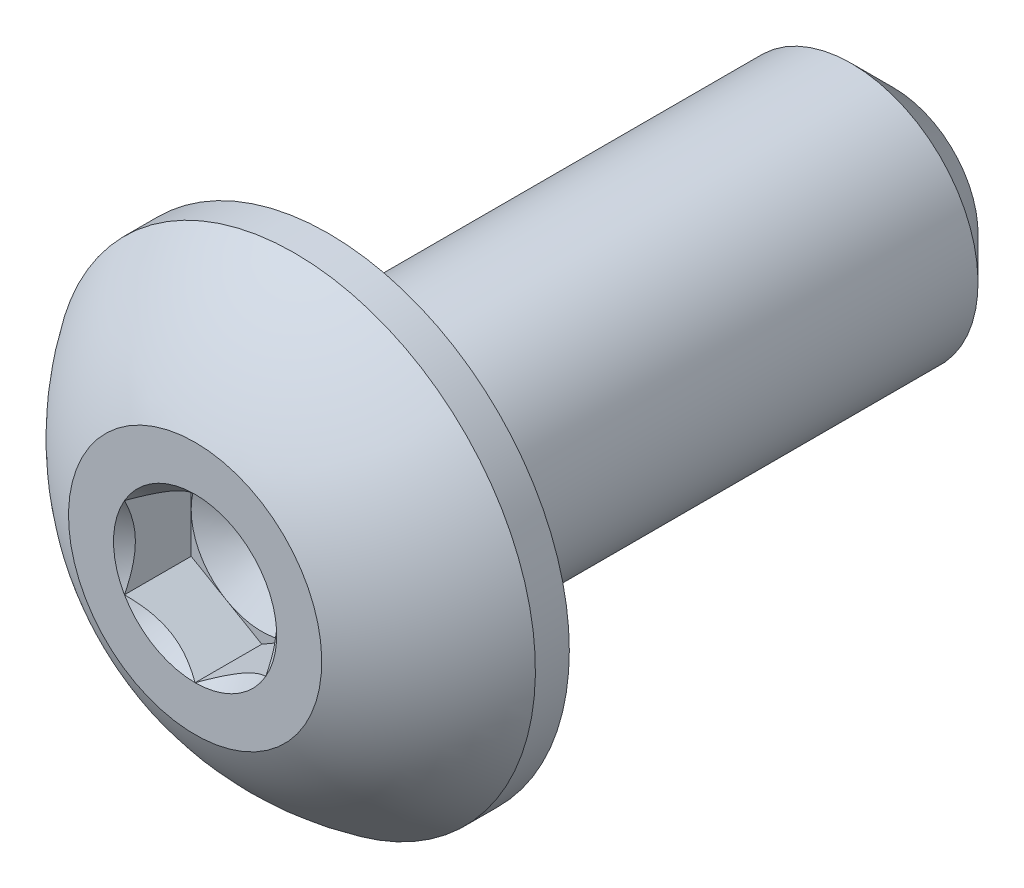
ISO-10303-21;
HEADER;
FILE_DESCRIPTION(('STEP AP214'),'2;1');
FILE_NAME('part.step','',(''),(''),'','','');
FILE_SCHEMA(('AUTOMOTIVE_DESIGN { 1 0 10303 214 1 1 1 1 }'));
ENDSEC;
DATA;
#1=APPLICATION_CONTEXT('core data for automotive mechanical design processes');
#2=APPLICATION_PROTOCOL_DEFINITION('international standard','automotive_design',2000,#1);
#3=PRODUCT_CONTEXT('',#1,'mechanical');
#4=PRODUCT('Part','Part','',(#3));
#5=PRODUCT_RELATED_PRODUCT_CATEGORY('part','',(#4));
#6=PRODUCT_DEFINITION_FORMATION('','',#4);
#7=PRODUCT_DEFINITION_CONTEXT('part definition',#1,'design');
#8=PRODUCT_DEFINITION('design','',#6,#7);
#9=PRODUCT_DEFINITION_SHAPE('','',#8);
#10=(LENGTH_UNIT() NAMED_UNIT(*) SI_UNIT(.MILLI.,.METRE.));
#11=(NAMED_UNIT(*) PLANE_ANGLE_UNIT() SI_UNIT($,.RADIAN.));
#12=(NAMED_UNIT(*) SI_UNIT($,.STERADIAN.) SOLID_ANGLE_UNIT());
#13=UNCERTAINTY_MEASURE_WITH_UNIT(LENGTH_MEASURE(1.E-05),#10,'distance_accuracy_value','');
#14=(GEOMETRIC_REPRESENTATION_CONTEXT(3) GLOBAL_UNCERTAINTY_ASSIGNED_CONTEXT((#13)) GLOBAL_UNIT_ASSIGNED_CONTEXT((#10,
#11,#12)) REPRESENTATION_CONTEXT('',''));
#15=CARTESIAN_POINT('',(0.,0.,0.));
#16=DIRECTION('',(0.,0.,1.));
#17=DIRECTION('',(1.,0.,0.));
#18=AXIS2_PLACEMENT_3D('',#15,#16,#17);
#19=CARTESIAN_POINT('',(0.79375,-1.3748153285078,0.7493));
#20=DIRECTION('',(0.,0.,1.));
#21=DIRECTION('',(1.,0.,0.));
#22=AXIS2_PLACEMENT_3D('',#19,#20,#21);
#23=PLANE('',#22);
#24=CARTESIAN_POINT('',(0.,0.,0.7493));
#25=DIRECTION('',(0.,0.,1.));
#26=DIRECTION('',(1.,0.,0.));
#27=AXIS2_PLACEMENT_3D('',#24,#25,#26);
#28=CIRCLE('',#27,0.79375);
#29=CARTESIAN_POINT('',(0.79375,0.,0.7493));
#30=VERTEX_POINT('',#29);
#31=CARTESIAN_POINT('',(0.396875,0.687407664253898,0.7493));
#32=VERTEX_POINT('',#31);
#33=EDGE_CURVE('E42',#30,#32,#28,.T.);
#34=ORIENTED_EDGE('',*,*,#33,.F.);
#35=DIRECTION('',(0.,1.,0.));
#36=VECTOR('',#35,1.);
#37=CARTESIAN_POINT('',(0.79375,-0.458271776169264,0.7493));
#38=LINE('',#37,#36);
#39=CARTESIAN_POINT('',(0.79375,0.458271776169267,0.7493));
#40=VERTEX_POINT('',#39);
#41=EDGE_CURVE('E112',#30,#40,#38,.T.);
#42=ORIENTED_EDGE('',*,*,#41,.T.);
#43=DIRECTION('',(-0.866025403784438,0.5,0.));
#44=VECTOR('',#43,1.);
#45=CARTESIAN_POINT('',(0.79375,0.458271776169267,0.7493));
#46=LINE('',#45,#44);
#47=EDGE_CURVE('E115',#40,#32,#46,.T.);
#48=ORIENTED_EDGE('',*,*,#47,.T.);
#49=EDGE_LOOP('',(#34,#42,#48));
#50=FACE_BOUND('',#49,.T.);
#51=ADVANCED_FACE('F31',(#50),#23,.T.);
#52=CARTESIAN_POINT('',(-0.396875,0.687407664253899,0.7493));
#53=VERTEX_POINT('',#52);
#54=EDGE_CURVE('E11',#32,#53,#28,.T.);
#55=ORIENTED_EDGE('',*,*,#54,.F.);
#56=CARTESIAN_POINT('',(0.,0.916543552338533,0.7493));
#57=VERTEX_POINT('',#56);
#58=EDGE_CURVE('E129',#32,#57,#46,.T.);
#59=ORIENTED_EDGE('',*,*,#58,.T.);
#60=DIRECTION('',(-0.866025403784439,-0.5,0.));
#61=VECTOR('',#60,1.);
#62=CARTESIAN_POINT('',(0.,0.916543552338533,0.7493));
#63=LINE('',#62,#61);
#64=EDGE_CURVE('E135',#57,#53,#63,.T.);
#65=ORIENTED_EDGE('',*,*,#64,.T.);
#66=EDGE_LOOP('',(#55,#59,#65));
#67=FACE_BOUND('',#66,.T.);
#68=ADVANCED_FACE('F191',(#67),#23,.T.);
#69=CARTESIAN_POINT('',(-0.79375,0.,0.7493));
#70=VERTEX_POINT('',#69);
#71=EDGE_CURVE('E40',#53,#70,#28,.T.);
#72=ORIENTED_EDGE('',*,*,#71,.F.);
#73=CARTESIAN_POINT('',(-0.79375,0.458271776169267,0.7493));
#74=VERTEX_POINT('',#73);
#75=EDGE_CURVE('E134',#53,#74,#63,.T.);
#76=ORIENTED_EDGE('',*,*,#75,.T.);
#77=DIRECTION('',(0.,-1.,0.));
#78=VECTOR('',#77,1.);
#79=CARTESIAN_POINT('',(-0.79375,0.458271776169267,0.7493));
#80=LINE('',#79,#78);
#81=EDGE_CURVE('E139',#74,#70,#80,.T.);
#82=ORIENTED_EDGE('',*,*,#81,.T.);
#83=EDGE_LOOP('',(#72,#76,#82));
#84=FACE_BOUND('',#83,.T.);
#85=ADVANCED_FACE('F196',(#84),#23,.T.);
#86=CARTESIAN_POINT('',(-0.396875,-0.687407664253898,0.7493));
#87=VERTEX_POINT('',#86);
#88=EDGE_CURVE('E226',#70,#87,#28,.T.);
#89=ORIENTED_EDGE('',*,*,#88,.F.);
#90=CARTESIAN_POINT('',(-0.79375,-0.458271776169264,0.7493));
#91=VERTEX_POINT('',#90);
#92=EDGE_CURVE('E138',#70,#91,#80,.T.);
#93=ORIENTED_EDGE('',*,*,#92,.T.);
#94=DIRECTION('',(0.866025403784439,-0.5,0.));
#95=VECTOR('',#94,1.);
#96=CARTESIAN_POINT('',(-0.79375,-0.458271776169264,0.7493));
#97=LINE('',#96,#95);
#98=EDGE_CURVE('E231',#91,#87,#97,.T.);
#99=ORIENTED_EDGE('',*,*,#98,.T.);
#100=EDGE_LOOP('',(#89,#93,#99));
#101=FACE_BOUND('',#100,.T.);
#102=ADVANCED_FACE('F214',(#101),#23,.T.);
#103=CARTESIAN_POINT('',(0.396874999999999,-0.687407664253897,0.7493));
#104=VERTEX_POINT('',#103);
#105=EDGE_CURVE('E49',#87,#104,#28,.T.);
#106=ORIENTED_EDGE('',*,*,#105,.F.);
#107=CARTESIAN_POINT('',(0.,-0.916543552338529,0.7493));
#108=VERTEX_POINT('',#107);
#109=EDGE_CURVE('E223',#87,#108,#97,.T.);
#110=ORIENTED_EDGE('',*,*,#109,.T.);
#111=DIRECTION('',(0.866025403784439,0.5,0.));
#112=VECTOR('',#111,1.);
#113=CARTESIAN_POINT('',(0.,-0.916543552338529,0.7493));
#114=LINE('',#113,#112);
#115=EDGE_CURVE('E124',#108,#104,#114,.T.);
#116=ORIENTED_EDGE('',*,*,#115,.T.);
#117=EDGE_LOOP('',(#106,#110,#116));
#118=FACE_BOUND('',#117,.T.);
#119=ADVANCED_FACE('F203',(#118),#23,.T.);
#120=CARTESIAN_POINT('',(0.,0.,0.));
#121=DIRECTION('',(0.,0.,-1.));
#122=DIRECTION('',(0.,1.,0.));
#123=AXIS2_PLACEMENT_3D('',#120,#121,#122);
#124=CYLINDRICAL_SURFACE('',#123,1.4224);
#125=CARTESIAN_POINT('',(0.,0.,-5.87374999999999));
#126=DIRECTION('',(0.,0.,-1.));
#127=DIRECTION('',(0.,1.,0.));
#128=AXIS2_PLACEMENT_3D('',#125,#126,#127);
#129=CIRCLE('',#128,1.4224);
#130=CARTESIAN_POINT('',(0.,1.4224,-5.87374999999999));
#131=VERTEX_POINT('',#130);
#132=EDGE_CURVE('E35',#131,#131,#129,.F.);
#133=ORIENTED_EDGE('',*,*,#132,.T.);
#134=EDGE_LOOP('',(#133));
#135=FACE_BOUND('',#134,.T.);
#136=CARTESIAN_POINT('',(0.,0.,0.));
#137=DIRECTION('',(0.,0.,1.));
#138=DIRECTION('',(1.,0.,0.));
#139=AXIS2_PLACEMENT_3D('',#136,#137,#138);
#140=CIRCLE('',#139,1.4224);
#141=CARTESIAN_POINT('',(1.4224,0.,0.));
#142=VERTEX_POINT('',#141);
#143=EDGE_CURVE('E166',#142,#142,#140,.F.);
#144=ORIENTED_EDGE('',*,*,#143,.T.);
#145=EDGE_LOOP('',(#144));
#146=FACE_BOUND('',#145,.T.);
#147=ADVANCED_FACE('F175',(#135,#146),#124,.T.);
#148=CARTESIAN_POINT('',(0.,0.,-6.35));
#149=DIRECTION('',(0.,0.,-1.));
#150=DIRECTION('',(0.,1.,0.));
#151=AXIS2_PLACEMENT_3D('',#148,#149,#150);
#152=PLANE('',#151);
#153=CARTESIAN_POINT('',(0.,0.,-6.35));
#154=DIRECTION('',(0.,0.,-1.));
#155=DIRECTION('',(0.,1.,0.));
#156=AXIS2_PLACEMENT_3D('',#153,#154,#155);
#157=CIRCLE('',#156,0.946149999999999);
#158=CARTESIAN_POINT('',(0.,0.94615,-6.35));
#159=VERTEX_POINT('',#158);
#160=EDGE_CURVE('E168',#159,#159,#157,.T.);
#161=ORIENTED_EDGE('',*,*,#160,.T.);
#162=EDGE_LOOP('',(#161));
#163=FACE_BOUND('',#162,.T.);
#164=ADVANCED_FACE('F181',(#163),#152,.T.);
#165=CARTESIAN_POINT('',(0.,0.,-6.35));
#166=DIRECTION('',(0.,0.,1.));
#167=DIRECTION('',(0.,-1.,0.));
#168=AXIS2_PLACEMENT_3D('',#165,#166,#167);
#169=CONICAL_SURFACE('',#168,0.946149999999999,0.785398163397445);
#170=ORIENTED_EDGE('',*,*,#132,.F.);
#171=EDGE_LOOP('',(#170));
#172=FACE_BOUND('',#171,.T.);
#173=ORIENTED_EDGE('',*,*,#160,.F.);
#174=EDGE_LOOP('',(#173));
#175=FACE_BOUND('',#174,.T.);
#176=ADVANCED_FACE('F33',(#172,#175),#169,.T.);
#177=CARTESIAN_POINT('',(0.,0.,9.14977821515092));
#178=DIRECTION('',(0.,0.,-1.));
#179=DIRECTION('',(-1.,0.,0.));
#180=AXIS2_PLACEMENT_3D('',#177,#178,#179);
#181=CYLINDRICAL_SURFACE('',#180,2.7051);
#182=CARTESIAN_POINT('',(0.,0.,0.381));
#183=DIRECTION('',(0.,0.,-1.));
#184=DIRECTION('',(0.,1.,0.));
#185=AXIS2_PLACEMENT_3D('',#182,#183,#184);
#186=CIRCLE('',#185,2.7051);
#187=CARTESIAN_POINT('',(0.,2.7051,0.381));
#188=VERTEX_POINT('',#187);
#189=EDGE_CURVE('E160',#188,#188,#186,.T.);
#190=ORIENTED_EDGE('',*,*,#189,.T.);
#191=EDGE_LOOP('',(#190));
#192=FACE_BOUND('',#191,.T.);
#193=CARTESIAN_POINT('',(0.,0.,0.));
#194=DIRECTION('',(0.,0.,1.));
#195=DIRECTION('',(1.,0.,0.));
#196=AXIS2_PLACEMENT_3D('',#193,#194,#195);
#197=CIRCLE('',#196,2.7051);
#198=CARTESIAN_POINT('',(2.7051,0.,0.));
#199=VERTEX_POINT('',#198);
#200=EDGE_CURVE('E163',#199,#199,#197,.T.);
#201=ORIENTED_EDGE('',*,*,#200,.T.);
#202=EDGE_LOOP('',(#201));
#203=FACE_BOUND('',#202,.T.);
#204=ADVANCED_FACE('F180',(#192,#203),#181,.T.);
#205=CARTESIAN_POINT('',(0.,0.,0.));
#206=DIRECTION('',(0.,0.,1.));
#207=DIRECTION('',(1.,0.,0.));
#208=AXIS2_PLACEMENT_3D('',#205,#206,#207);
#209=PLANE('',#208);
#210=ORIENTED_EDGE('',*,*,#143,.F.);
#211=EDGE_LOOP('',(#210));
#212=FACE_BOUND('',#211,.T.);
#213=ORIENTED_EDGE('',*,*,#200,.F.);
#214=EDGE_LOOP('',(#213));
#215=FACE_BOUND('',#214,.T.);
#216=ADVANCED_FACE('F186',(#212,#215),#209,.F.);
#217=CARTESIAN_POINT('',(0.,0.,-1.42882215909091));
#218=DIRECTION('',(0.,0.,-1.));
#219=DIRECTION('',(0.,1.,0.));
#220=AXIS2_PLACEMENT_3D('',#217,#218,#219);
#221=SPHERICAL_SURFACE('',#220,3.25469234452912);
#222=ORIENTED_EDGE('',*,*,#189,.F.);
#223=EDGE_LOOP('',(#222));
#224=FACE_BOUND('',#223,.T.);
#225=CARTESIAN_POINT('',(0.,0.,1.4986));
#226=DIRECTION('',(0.,0.,-1.));
#227=DIRECTION('',(0.,1.,0.));
#228=AXIS2_PLACEMENT_3D('',#225,#226,#227);
#229=CIRCLE('',#228,1.4224);
#230=CARTESIAN_POINT('',(0.,1.4224,1.4986));
#231=VERTEX_POINT('',#230);
#232=EDGE_CURVE('E146',#231,#231,#229,.T.);
#233=ORIENTED_EDGE('',*,*,#232,.T.);
#234=EDGE_LOOP('',(#233));
#235=FACE_BOUND('',#234,.T.);
#236=ADVANCED_FACE('F425',(#224,#235),#221,.T.);
#237=CARTESIAN_POINT('',(0.,0.,1.4986));
#238=DIRECTION('',(0.,0.,1.));
#239=DIRECTION('',(1.,0.,0.));
#240=AXIS2_PLACEMENT_3D('',#237,#238,#239);
#241=PLANE('',#240);
#242=CARTESIAN_POINT('',(0.,0.,1.4986));
#243=DIRECTION('',(0.,0.,1.));
#244=DIRECTION('',(1.,0.,0.));
#245=AXIS2_PLACEMENT_3D('',#242,#243,#244);
#246=CIRCLE('',#245,0.916543552338529);
#247=CARTESIAN_POINT('',(0.79375,0.458271776169263,1.4986));
#248=VERTEX_POINT('',#247);
#249=CARTESIAN_POINT('',(0.,0.916543552338529,1.4986));
#250=VERTEX_POINT('',#249);
#251=EDGE_CURVE('E486',#248,#250,#246,.T.);
#252=ORIENTED_EDGE('',*,*,#251,.F.);
#253=CARTESIAN_POINT('',(0.79375,-0.458271776169264,1.4986));
#254=VERTEX_POINT('',#253);
#255=EDGE_CURVE('E490',#254,#248,#246,.T.);
#256=ORIENTED_EDGE('',*,*,#255,.F.);
#257=CARTESIAN_POINT('',(0.,-0.916543552338529,1.4986));
#258=VERTEX_POINT('',#257);
#259=EDGE_CURVE('E496',#258,#254,#246,.T.);
#260=ORIENTED_EDGE('',*,*,#259,.F.);
#261=CARTESIAN_POINT('',(-0.79375,-0.458271776169262,1.4986));
#262=VERTEX_POINT('',#261);
#263=EDGE_CURVE('E499',#262,#258,#246,.T.);
#264=ORIENTED_EDGE('',*,*,#263,.F.);
#265=CARTESIAN_POINT('',(-0.793749999999995,0.45827177616927,1.4986));
#266=VERTEX_POINT('',#265);
#267=EDGE_CURVE('E56',#266,#262,#246,.T.);
#268=ORIENTED_EDGE('',*,*,#267,.F.);
#269=EDGE_CURVE('E491',#250,#266,#246,.T.);
#270=ORIENTED_EDGE('',*,*,#269,.F.);
#271=EDGE_LOOP('',(#252,#256,#260,#264,#268,#270));
#272=FACE_BOUND('',#271,.T.);
#273=ORIENTED_EDGE('',*,*,#232,.F.);
#274=EDGE_LOOP('',(#273));
#275=FACE_BOUND('',#274,.T.);
#276=ADVANCED_FACE('F403',(#272,#275),#241,.T.);
#277=CARTESIAN_POINT('',(0.,0.,1.4986));
#278=DIRECTION('',(0.,0.,1.));
#279=DIRECTION('',(1.,0.,0.));
#280=AXIS2_PLACEMENT_3D('',#277,#278,#279);
#281=CONICAL_SURFACE('',#280,0.916543552338529,0.78539816339745);
#282=ORIENTED_EDGE('',*,*,#259,.T.);
#283=CARTESIAN_POINT('',(-0.000200000000000455,-0.916659022392367,1.4987154918722));
#284=CARTESIAN_POINT('',(0.0270936731708993,-0.900901012839974,1.48296677881996));
#285=CARTESIAN_POINT('',(0.0548437622982907,-0.884879491412239,1.46814254758418));
#286=CARTESIAN_POINT('',(0.111429749536839,-0.852209556447702,1.44099903778594));
#287=CARTESIAN_POINT('',(0.140271036646688,-0.835558031571056,1.42869487372838));
#288=CARTESIAN_POINT('',(0.198428320979554,-0.801980907806138,1.4076173665706));
#289=CARTESIAN_POINT('',(0.227729485202779,-0.78506387275429,1.39879100814755));
#290=CARTESIAN_POINT('',(0.286976842886976,-0.750857394846545,1.38519123872424));
#291=CARTESIAN_POINT('',(0.316921224361637,-0.733568998141432,1.38040766812998));
#292=CARTESIAN_POINT('',(0.368524622466451,-0.703775762354518,1.37609340945595));
#293=CARTESIAN_POINT('',(0.390116468258511,-0.691309704374172,1.37545527141097));
#294=CARTESIAN_POINT('',(0.433258367277031,-0.666401717362478,1.37652613979119));
#295=CARTESIAN_POINT('',(0.454808410236484,-0.65395979425879,1.37823566388179));
#296=CARTESIAN_POINT('',(0.519150845544782,-0.616811671913228,1.38677279115859));
#297=CARTESIAN_POINT('',(0.561623053980694,-0.592290330939676,1.39700991913679));
#298=CARTESIAN_POINT('',(0.636174390780281,-0.549248096569988,1.42171858984055));
#299=CARTESIAN_POINT('',(0.668602787817666,-0.530525552811065,1.43489617467531));
#300=CARTESIAN_POINT('',(0.732189146461483,-0.49381395153127,1.46458103995168));
#301=CARTESIAN_POINT('',(0.763350854631517,-0.475822730930892,1.48107748789317));
#302=CARTESIAN_POINT('',(0.79395,-0.458156306115426,1.4987154918722));
#303=B_SPLINE_CURVE_WITH_KNOTS('',3,(#283,#284,#285,#286,#287,#288,#289,#290,#291,#292,#293,
#294,#295,#296,#297,#298,#299,#300,#301,#302),.UNSPECIFIED.,.F.,.F.,(4,2,2,2,2,2,2,2,2,4),(0.,
0.105768699105621,0.21215429718622,0.316848842533858,0.421279499712345,0.495991864977073,
0.570720707151282,0.720221070373883,0.839150369964801,0.957697614118391),.UNSPECIFIED.);
#304=EDGE_CURVE('E256',#258,#254,#303,.T.);
#305=ORIENTED_EDGE('',*,*,#304,.F.);
#306=EDGE_LOOP('',(#282,#305));
#307=FACE_BOUND('',#306,.T.);
#308=ADVANCED_FACE('F212',(#307),#281,.F.);
#309=ORIENTED_EDGE('',*,*,#255,.T.);
#310=CARTESIAN_POINT('',(0.79375,-0.930523312873779,1.80513154686903));
#311=CARTESIAN_POINT('',(0.79375,-0.907938717568108,1.78795163801993));
#312=CARTESIAN_POINT('',(0.79375,-0.885230100372018,1.77093524884748));
#313=CARTESIAN_POINT('',(0.79375,-0.83951390138625,1.73729754968507));
#314=CARTESIAN_POINT('',(0.79375,-0.81650624817287,1.72067633686699));
#315=CARTESIAN_POINT('',(0.79375,-0.746621435652652,1.67127015014611));
#316=CARTESIAN_POINT('',(0.79375,-0.699225496572676,1.63920694226179));
#317=CARTESIAN_POINT('',(0.79375,-0.599729870318619,1.57610938356628));
#318=CARTESIAN_POINT('',(0.79375,-0.547518111602845,1.54524980287807));
#319=CARTESIAN_POINT('',(0.79375,-0.440465997521066,1.48869431939161));
#320=CARTESIAN_POINT('',(0.79375,-0.385635319588842,1.462980990208));
#321=CARTESIAN_POINT('',(0.79375,-0.303490919645501,1.43151828592316));
#322=CARTESIAN_POINT('',(0.79375,-0.277428588623871,1.42251658488986));
#323=CARTESIAN_POINT('',(0.79375,-0.224660266267594,1.40660365805206));
#324=CARTESIAN_POINT('',(0.79375,-0.197954232107697,1.39969257175189));
#325=CARTESIAN_POINT('',(0.79375,-0.144516677526958,1.38844073487269));
#326=CARTESIAN_POINT('',(0.79375,-0.117794877403843,1.38405455104384));
#327=CARTESIAN_POINT('',(0.79375,-0.0640385307880295,1.37793807645136));
#328=CARTESIAN_POINT('',(0.79375,-0.037003941658247,1.37620815217119));
#329=CARTESIAN_POINT('',(0.79375,0.0160384595788292,1.37554283034023));
#330=CARTESIAN_POINT('',(0.79375,0.0420449606060605,1.37650050108268));
#331=CARTESIAN_POINT('',(0.79375,0.093845497213574,1.38091790993338));
#332=CARTESIAN_POINT('',(0.79375,0.11963949213758,1.38437811607282));
#333=CARTESIAN_POINT('',(0.79375,0.171261622869057,1.39366770326333));
#334=CARTESIAN_POINT('',(0.79375,0.197082302323078,1.3995378826003));
#335=CARTESIAN_POINT('',(0.79375,0.248157270984135,1.4133304606982));
#336=CARTESIAN_POINT('',(0.79375,0.273411601594531,1.42125270890617));
#337=CARTESIAN_POINT('',(0.79375,0.352183480672703,1.44896346635406));
#338=CARTESIAN_POINT('',(0.79375,0.404598779993784,1.4718769639291));
#339=CARTESIAN_POINT('',(0.79375,0.506973354577988,1.5228423731992));
#340=CARTESIAN_POINT('',(0.79375,0.556923045144656,1.55091259799278));
#341=CARTESIAN_POINT('',(0.79375,0.652394168745675,1.60884556234195));
#342=CARTESIAN_POINT('',(0.79375,0.698012407471607,1.63855075951651));
#343=CARTESIAN_POINT('',(0.79375,0.765221422184928,1.68448125421725));
#344=CARTESIAN_POINT('',(0.79375,0.787334753284685,1.69995518303451));
#345=CARTESIAN_POINT('',(0.79375,0.831258721493259,1.73131476145367));
#346=CARTESIAN_POINT('',(0.79375,0.853069439825473,1.74720029716127));
#347=CARTESIAN_POINT('',(0.79375,0.874754064753108,1.76325657308564));
#348=B_SPLINE_CURVE_WITH_KNOTS('',3,(#310,#311,#312,#313,#314,#315,#316,#317,#318,#319,#320,
#321,#322,#323,#324,#325,#326,#327,#328,#329,#330,#331,#332,#333,#334,#335,#336,#337,#338,#339,
#340,#341,#342,#343,#344,#345,#346,#347),.UNSPECIFIED.,.F.,.F.,(4,2,2,2,2,2,2,2,2,2,2,2,2,2,2,2,
2,2,4),(0.,0.0851267212699211,0.170274162697199,0.341867540062669,0.523672188154065,
0.704850381262152,0.787500098686151,0.870155330015478,0.951272603586192,1.03240106788106,
1.11034793766582,1.18830938906372,1.26764895162694,1.34698269497801,1.51809534529198,
1.68982784691028,1.85305831881697,1.93402417500375,2.01496786175293),.UNSPECIFIED.);
#349=EDGE_CURVE('E264',#254,#248,#348,.T.);
#350=ORIENTED_EDGE('',*,*,#349,.F.);
#351=EDGE_LOOP('',(#309,#350));
#352=FACE_BOUND('',#351,.T.);
#353=ADVANCED_FACE('F388',(#352),#281,.F.);
#354=ORIENTED_EDGE('',*,*,#251,.T.);
#355=CARTESIAN_POINT('',(0.793949999999999,0.458156306115429,1.4987154918722));
#356=CARTESIAN_POINT('',(0.7666563268291,0.473914315667822,1.48296677881996));
#357=CARTESIAN_POINT('',(0.738906237701709,0.489935837095558,1.46814254758418));
#358=CARTESIAN_POINT('',(0.68232025046316,0.522605772060094,1.44099903778594));
#359=CARTESIAN_POINT('',(0.653478963353312,0.53925729693674,1.42869487372838));
#360=CARTESIAN_POINT('',(0.595321679020446,0.572834420701658,1.4076173665706));
#361=CARTESIAN_POINT('',(0.566020514797221,0.589751455753507,1.39879100814755));
#362=CARTESIAN_POINT('',(0.506773157113025,0.623957933661252,1.38519123872424));
#363=CARTESIAN_POINT('',(0.476828775638364,0.641246330366364,1.38040766812999));
#364=CARTESIAN_POINT('',(0.425225377533549,0.671039566153278,1.37609340945595));
#365=CARTESIAN_POINT('',(0.40363353174149,0.683505624133624,1.37545527141097));
#366=CARTESIAN_POINT('',(0.360491632722969,0.708413611145319,1.3765261397912));
#367=CARTESIAN_POINT('',(0.338941589763516,0.720855534249007,1.37823566388179));
#368=CARTESIAN_POINT('',(0.274599154455218,0.758003656594569,1.3867727911586));
#369=CARTESIAN_POINT('',(0.232126946019306,0.782524997568121,1.3970099191368));
#370=CARTESIAN_POINT('',(0.157575609219719,0.825567231937809,1.42171858984055));
#371=CARTESIAN_POINT('',(0.125147212182333,0.844289775696731,1.43489617467531));
#372=CARTESIAN_POINT('',(0.0615608535385166,0.881001376976527,1.46458103995168));
#373=CARTESIAN_POINT('',(0.0303991453684829,0.898992597576905,1.48107748789317));
#374=CARTESIAN_POINT('',(-0.000200000000000255,0.916659022392371,1.4987154918722));
#375=B_SPLINE_CURVE_WITH_KNOTS('',3,(#355,#356,#357,#358,#359,#360,#361,#362,#363,#364,#365,
#366,#367,#368,#369,#370,#371,#372,#373,#374),.UNSPECIFIED.,.F.,.F.,(4,2,2,2,2,2,2,2,2,4),(0.,
0.105768699105621,0.212154297186219,0.316848842533857,0.421279499712344,0.495991864977072,
0.570720707151281,0.720221070373882,0.8391503699648,0.957697614118391),.UNSPECIFIED.);
#376=EDGE_CURVE('E271',#248,#250,#375,.T.);
#377=ORIENTED_EDGE('',*,*,#376,.F.);
#378=EDGE_LOOP('',(#354,#377));
#379=FACE_BOUND('',#378,.T.);
#380=ADVANCED_FACE('F380',(#379),#281,.F.);
#381=ORIENTED_EDGE('',*,*,#269,.T.);
#382=CARTESIAN_POINT('',(0.00019999999999984,0.916659022392371,1.4987154918722));
#383=CARTESIAN_POINT('',(-0.0270936731709001,0.900901012839978,1.48296677881996));
#384=CARTESIAN_POINT('',(-0.0548437622982915,0.884879491412243,1.46814254758418));
#385=CARTESIAN_POINT('',(-0.11142974953684,0.852209556447706,1.44099903778594));
#386=CARTESIAN_POINT('',(-0.140271036646689,0.835558031571059,1.42869487372838));
#387=CARTESIAN_POINT('',(-0.198428320979556,0.801980907806141,1.4076173665706));
#388=CARTESIAN_POINT('',(-0.22772948520278,0.785063872754293,1.39879100814755));
#389=CARTESIAN_POINT('',(-0.286976842886977,0.750857394846548,1.38519123872424));
#390=CARTESIAN_POINT('',(-0.316921224361638,0.733568998141436,1.38040766812999));
#391=CARTESIAN_POINT('',(-0.368524622466453,0.703775762354521,1.37609340945595));
#392=CARTESIAN_POINT('',(-0.390116468258512,0.691309704374175,1.37545527141097));
#393=CARTESIAN_POINT('',(-0.433258367277033,0.666401717362481,1.3765261397912));
#394=CARTESIAN_POINT('',(-0.454808410236486,0.653959794258792,1.37823566388179));
#395=CARTESIAN_POINT('',(-0.519150845544784,0.61681167191323,1.3867727911586));
#396=CARTESIAN_POINT('',(-0.561623053980697,0.592290330939678,1.3970099191368));
#397=CARTESIAN_POINT('',(-0.636174390780283,0.549248096569991,1.42171858984055));
#398=CARTESIAN_POINT('',(-0.668602787817668,0.530525552811068,1.43489617467531));
#399=CARTESIAN_POINT('',(-0.732189146461484,0.493813951531273,1.46458103995168));
#400=CARTESIAN_POINT('',(-0.763350854631517,0.475822730930895,1.48107748789317));
#401=CARTESIAN_POINT('',(-0.79395,0.45815630611543,1.4987154918722));
#402=B_SPLINE_CURVE_WITH_KNOTS('',3,(#382,#383,#384,#385,#386,#387,#388,#389,#390,#391,#392,
#393,#394,#395,#396,#397,#398,#399,#400,#401),.UNSPECIFIED.,.F.,.F.,(4,2,2,2,2,2,2,2,2,4),(0.,
0.105768699105622,0.21215429718622,0.316848842533859,0.421279499712347,0.495991864977074,
0.570720707151284,0.720221070373885,0.839150369964802,0.957697614118391),.UNSPECIFIED.);
#403=EDGE_CURVE('E276',#250,#266,#402,.T.);
#404=ORIENTED_EDGE('',*,*,#403,.F.);
#405=EDGE_LOOP('',(#381,#404));
#406=FACE_BOUND('',#405,.T.);
#407=ADVANCED_FACE('F373',(#406),#281,.F.);
#408=ORIENTED_EDGE('',*,*,#267,.T.);
#409=CARTESIAN_POINT('',(-0.79375,-0.930523312845418,1.80513154684746));
#410=CARTESIAN_POINT('',(-0.79375,-0.907938717540552,1.78795163799919));
#411=CARTESIAN_POINT('',(-0.79375,-0.88523010034527,1.77093524882756));
#412=CARTESIAN_POINT('',(-0.79375,-0.839513901361125,1.73729754966682));
#413=CARTESIAN_POINT('',(-0.79375,-0.816506248148561,1.72067633684956));
#414=CARTESIAN_POINT('',(-0.79375,-0.746621435630839,1.67127015013118));
#415=CARTESIAN_POINT('',(-0.79375,-0.69922549655256,1.63920694224851));
#416=CARTESIAN_POINT('',(-0.79375,-0.599729870302204,1.57610938355642));
#417=CARTESIAN_POINT('',(-0.79375,-0.547518111588444,1.54524980286995));
#418=CARTESIAN_POINT('',(-0.79375,-0.440465997510864,1.48869431938673));
#419=CARTESIAN_POINT('',(-0.79375,-0.385635319580823,1.46298099020461));
#420=CARTESIAN_POINT('',(-0.79375,-0.30349091963912,1.43151828592086));
#421=CARTESIAN_POINT('',(-0.79375,-0.277428588616795,1.4225165848875));
#422=CARTESIAN_POINT('',(-0.79375,-0.224660266259103,1.40660365804972));
#423=CARTESIAN_POINT('',(-0.79375,-0.197954232098486,1.39969257174964));
#424=CARTESIAN_POINT('',(-0.79375,-0.144516677516331,1.38844073487076));
#425=CARTESIAN_POINT('',(-0.79375,-0.11779487739252,1.38405455104215));
#426=CARTESIAN_POINT('',(-0.79375,-0.0640385307753352,1.37793807645032));
#427=CARTESIAN_POINT('',(-0.79375,-0.0370039416448776,1.37620815217055));
#428=CARTESIAN_POINT('',(-0.79375,0.0160384595934048,1.37554283034051));
#429=CARTESIAN_POINT('',(-0.79375,0.0420449606211689,1.37650050108347));
#430=CARTESIAN_POINT('',(-0.79375,0.0938454972296932,1.38091790993526));
#431=CARTESIAN_POINT('',(-0.79375,0.119639492154177,1.38437811607528));
#432=CARTESIAN_POINT('',(-0.79375,0.171261622886597,1.39366770326701));
#433=CARTESIAN_POINT('',(-0.79375,0.197082302341082,1.39953788260463));
#434=CARTESIAN_POINT('',(-0.79375,0.24815727100302,1.41333046070383));
#435=CARTESIAN_POINT('',(-0.79375,0.273411601613832,1.42125270891245));
#436=CARTESIAN_POINT('',(-0.793750000000001,0.352183480696166,1.44896346636341));
#437=CARTESIAN_POINT('',(-0.79375,0.404598780020782,1.47187696394126));
#438=CARTESIAN_POINT('',(-0.79375,0.506973354611786,1.52284237321731));
#439=CARTESIAN_POINT('',(-0.79375,0.556923045181717,1.55091259801402));
#440=CARTESIAN_POINT('',(-0.79375,0.652394168788597,1.60884556236918));
#441=CARTESIAN_POINT('',(-0.793750000000001,0.69801240751715,1.63855075954657));
#442=CARTESIAN_POINT('',(-0.793750000000001,0.765221422234345,1.68448125425154));
#443=CARTESIAN_POINT('',(-0.793750000000001,0.787334753335375,1.69995518307021));
#444=CARTESIAN_POINT('',(-0.793750000000001,0.831258721546487,1.73131476149216));
#445=CARTESIAN_POINT('',(-0.793750000000001,0.853069439879965,1.74720029720116));
#446=CARTESIAN_POINT('',(-0.793750000000001,0.874754064808862,1.76325657312693));
#447=B_SPLINE_CURVE_WITH_KNOTS('',3,(#409,#410,#411,#412,#413,#414,#415,#416,#417,#418,#419,
#420,#421,#422,#423,#424,#425,#426,#427,#428,#429,#430,#431,#432,#433,#434,#435,#436,#437,#438,
#439,#440,#441,#442,#443,#444,#445,#446),.UNSPECIFIED.,.F.,.F.,(4,2,2,2,2,2,2,2,2,2,2,2,2,2,2,2,
2,2,4),(0.,0.085126721266486,0.170274162690328,0.341867540048798,0.523672188132332,
0.704850381232633,0.787500098658654,0.87015532999,0.951272603562646,1.03240106785945,
1.11034793764585,1.1883093890454,1.26764895161041,1.34698269496326,1.51809534529028,
1.68982784692171,1.85305831883963,1.93402417503194,2.01496786178666),.UNSPECIFIED.);
#448=EDGE_CURVE('E243',#266,#262,#447,.F.);
#449=ORIENTED_EDGE('',*,*,#448,.F.);
#450=EDGE_LOOP('',(#408,#449));
#451=FACE_BOUND('',#450,.T.);
#452=ADVANCED_FACE('F210',(#451),#281,.F.);
#453=ORIENTED_EDGE('',*,*,#263,.T.);
#454=CARTESIAN_POINT('',(-0.79395,-0.458156306115426,1.4987154918722));
#455=CARTESIAN_POINT('',(-0.7666563268291,-0.473914315667819,1.48296677881996));
#456=CARTESIAN_POINT('',(-0.738906237701709,-0.489935837095554,1.46814254758418));
#457=CARTESIAN_POINT('',(-0.68232025046316,-0.522605772060091,1.44099903778594));
#458=CARTESIAN_POINT('',(-0.653478963353312,-0.539257296936738,1.42869487372838));
#459=CARTESIAN_POINT('',(-0.595321679020445,-0.572834420701656,1.4076173665706));
#460=CARTESIAN_POINT('',(-0.56602051479722,-0.589751455753504,1.39879100814755));
#461=CARTESIAN_POINT('',(-0.506773157113023,-0.623957933661249,1.38519123872424));
#462=CARTESIAN_POINT('',(-0.476828775638362,-0.641246330366361,1.38040766812998));
#463=CARTESIAN_POINT('',(-0.425225377533547,-0.671039566153276,1.37609340945595));
#464=CARTESIAN_POINT('',(-0.403633531741488,-0.683505624133622,1.37545527141097));
#465=CARTESIAN_POINT('',(-0.360491632722968,-0.708413611145316,1.37652613979119));
#466=CARTESIAN_POINT('',(-0.338941589763515,-0.720855534249005,1.37823566388179));
#467=CARTESIAN_POINT('',(-0.274599154455217,-0.758003656594566,1.38677279115859));
#468=CARTESIAN_POINT('',(-0.232126946019305,-0.782524997568118,1.39700991913679));
#469=CARTESIAN_POINT('',(-0.157575609219718,-0.825567231937806,1.42171858984055));
#470=CARTESIAN_POINT('',(-0.125147212182333,-0.844289775696729,1.43489617467531));
#471=CARTESIAN_POINT('',(-0.0615608535385167,-0.881001376976524,1.46458103995168));
#472=CARTESIAN_POINT('',(-0.0303991453684834,-0.898992597576901,1.48107748789317));
#473=CARTESIAN_POINT('',(0.000199999999999513,-0.916659022392367,1.4987154918722));
#474=B_SPLINE_CURVE_WITH_KNOTS('',3,(#454,#455,#456,#457,#458,#459,#460,#461,#462,#463,#464,
#465,#466,#467,#468,#469,#470,#471,#472,#473),.UNSPECIFIED.,.F.,.F.,(4,2,2,2,2,2,2,2,2,4),(0.,
0.105768699105621,0.21215429718622,0.316848842533859,0.421279499712347,0.495991864977074,
0.570720707151284,0.720221070373884,0.839150369964802,0.957697614118391),.UNSPECIFIED.);
#475=EDGE_CURVE('E233',#262,#258,#474,.T.);
#476=ORIENTED_EDGE('',*,*,#475,.F.);
#477=EDGE_LOOP('',(#453,#476));
#478=FACE_BOUND('',#477,.T.);
#479=ADVANCED_FACE('F202',(#478),#281,.F.);
#480=EDGE_CURVE('E102',#104,#30,#28,.T.);
#481=ORIENTED_EDGE('',*,*,#480,.F.);
#482=CARTESIAN_POINT('',(0.79375,-0.458271776169264,0.7493));
#483=VERTEX_POINT('',#482);
#484=EDGE_CURVE('E127',#104,#483,#114,.T.);
#485=ORIENTED_EDGE('',*,*,#484,.T.);
#486=EDGE_CURVE('E120',#483,#30,#38,.T.);
#487=ORIENTED_EDGE('',*,*,#486,.T.);
#488=EDGE_LOOP('',(#481,#485,#487));
#489=FACE_BOUND('',#488,.T.);
#490=ADVANCED_FACE('F126',(#489),#23,.T.);
#491=CARTESIAN_POINT('',(0.,-0.916543552338529,0.7493));
#492=DIRECTION('',(0.5,-0.866025403784439,0.));
#493=DIRECTION('',(0.866025403784439,0.5,0.));
#494=AXIS2_PLACEMENT_3D('',#491,#492,#493);
#495=PLANE('',#494);
#496=DIRECTION('',(0.,0.,1.));
#497=VECTOR('',#496,1.);
#498=CARTESIAN_POINT('',(0.,-0.916543552338529,0.7493));
#499=LINE('',#498,#497);
#500=EDGE_CURVE('E142',#108,#258,#499,.T.);
#501=ORIENTED_EDGE('',*,*,#500,.T.);
#502=ORIENTED_EDGE('',*,*,#304,.T.);
#503=DIRECTION('',(0.,0.,1.));
#504=VECTOR('',#503,1.);
#505=CARTESIAN_POINT('',(0.79375,-0.458271776169264,0.7493));
#506=LINE('',#505,#504);
#507=EDGE_CURVE('E154',#483,#254,#506,.T.);
#508=ORIENTED_EDGE('',*,*,#507,.F.);
#509=ORIENTED_EDGE('',*,*,#484,.F.);
#510=ORIENTED_EDGE('',*,*,#115,.F.);
#511=EDGE_LOOP('',(#501,#502,#508,#509,#510));
#512=FACE_BOUND('',#511,.T.);
#513=ADVANCED_FACE('F201',(#512),#495,.F.);
#514=CARTESIAN_POINT('',(0.79375,-0.458271776169264,0.7493));
#515=DIRECTION('',(1.,0.,0.));
#516=DIRECTION('',(0.,1.,0.));
#517=AXIS2_PLACEMENT_3D('',#514,#515,#516);
#518=PLANE('',#517);
#519=ORIENTED_EDGE('',*,*,#507,.T.);
#520=ORIENTED_EDGE('',*,*,#349,.T.);
#521=DIRECTION('',(0.,0.,1.));
#522=VECTOR('',#521,1.);
#523=CARTESIAN_POINT('',(0.79375,0.458271776169267,0.7493));
#524=LINE('',#523,#522);
#525=EDGE_CURVE('E123',#40,#248,#524,.T.);
#526=ORIENTED_EDGE('',*,*,#525,.F.);
#527=ORIENTED_EDGE('',*,*,#41,.F.);
#528=ORIENTED_EDGE('',*,*,#486,.F.);
#529=EDGE_LOOP('',(#519,#520,#526,#527,#528));
#530=FACE_BOUND('',#529,.T.);
#531=ADVANCED_FACE('F119',(#530),#518,.F.);
#532=CARTESIAN_POINT('',(0.79375,0.458271776169267,0.7493));
#533=DIRECTION('',(0.5,0.866025403784439,0.));
#534=DIRECTION('',(-0.866025403784439,0.5,0.));
#535=AXIS2_PLACEMENT_3D('',#532,#533,#534);
#536=PLANE('',#535);
#537=ORIENTED_EDGE('',*,*,#525,.T.);
#538=ORIENTED_EDGE('',*,*,#376,.T.);
#539=DIRECTION('',(0.,0.,1.));
#540=VECTOR('',#539,1.);
#541=CARTESIAN_POINT('',(0.,0.916543552338533,0.7493));
#542=LINE('',#541,#540);
#543=EDGE_CURVE('E150',#57,#250,#542,.T.);
#544=ORIENTED_EDGE('',*,*,#543,.F.);
#545=ORIENTED_EDGE('',*,*,#58,.F.);
#546=ORIENTED_EDGE('',*,*,#47,.F.);
#547=EDGE_LOOP('',(#537,#538,#544,#545,#546));
#548=FACE_BOUND('',#547,.T.);
#549=ADVANCED_FACE('F286',(#548),#536,.F.);
#550=CARTESIAN_POINT('',(0.,0.916543552338533,0.7493));
#551=DIRECTION('',(-0.5,0.866025403784439,0.));
#552=DIRECTION('',(-0.866025403784439,-0.5,0.));
#553=AXIS2_PLACEMENT_3D('',#550,#551,#552);
#554=PLANE('',#553);
#555=ORIENTED_EDGE('',*,*,#543,.T.);
#556=ORIENTED_EDGE('',*,*,#403,.T.);
#557=DIRECTION('',(0.,0.,1.));
#558=VECTOR('',#557,1.);
#559=CARTESIAN_POINT('',(-0.79375,0.458271776169267,0.7493));
#560=LINE('',#559,#558);
#561=EDGE_CURVE('E147',#74,#266,#560,.T.);
#562=ORIENTED_EDGE('',*,*,#561,.F.);
#563=ORIENTED_EDGE('',*,*,#75,.F.);
#564=ORIENTED_EDGE('',*,*,#64,.F.);
#565=EDGE_LOOP('',(#555,#556,#562,#563,#564));
#566=FACE_BOUND('',#565,.T.);
#567=ADVANCED_FACE('F282',(#566),#554,.F.);
#568=CARTESIAN_POINT('',(-0.79375,0.458271776169267,0.7493));
#569=DIRECTION('',(-1.,0.,0.));
#570=DIRECTION('',(0.,-1.,0.));
#571=AXIS2_PLACEMENT_3D('',#568,#569,#570);
#572=PLANE('',#571);
#573=ORIENTED_EDGE('',*,*,#561,.T.);
#574=ORIENTED_EDGE('',*,*,#448,.T.);
#575=DIRECTION('',(0.,0.,1.));
#576=VECTOR('',#575,1.);
#577=CARTESIAN_POINT('',(-0.79375,-0.458271776169264,0.7493));
#578=LINE('',#577,#576);
#579=EDGE_CURVE('E143',#91,#262,#578,.T.);
#580=ORIENTED_EDGE('',*,*,#579,.F.);
#581=ORIENTED_EDGE('',*,*,#92,.F.);
#582=ORIENTED_EDGE('',*,*,#81,.F.);
#583=EDGE_LOOP('',(#573,#574,#580,#581,#582));
#584=FACE_BOUND('',#583,.T.);
#585=ADVANCED_FACE('F285',(#584),#572,.F.);
#586=CARTESIAN_POINT('',(-0.79375,-0.458271776169264,0.7493));
#587=DIRECTION('',(-0.5,-0.866025403784439,0.));
#588=DIRECTION('',(0.866025403784439,-0.5,0.));
#589=AXIS2_PLACEMENT_3D('',#586,#587,#588);
#590=PLANE('',#589);
#591=ORIENTED_EDGE('',*,*,#579,.T.);
#592=ORIENTED_EDGE('',*,*,#475,.T.);
#593=ORIENTED_EDGE('',*,*,#500,.F.);
#594=ORIENTED_EDGE('',*,*,#109,.F.);
#595=ORIENTED_EDGE('',*,*,#98,.F.);
#596=EDGE_LOOP('',(#591,#592,#593,#594,#595));
#597=FACE_BOUND('',#596,.T.);
#598=ADVANCED_FACE('F230',(#597),#590,.F.);
#599=CARTESIAN_POINT('',(0.,0.,0.7493));
#600=DIRECTION('',(0.,0.,1.));
#601=DIRECTION('',(1.,0.,0.));
#602=AXIS2_PLACEMENT_3D('',#599,#600,#601);
#603=CONICAL_SURFACE('',#602,0.79375,1.0471975511966);
#604=CARTESIAN_POINT('',(0.,0.,0.499533333333333));
#605=DIRECTION('',(0.,0.,1.));
#606=DIRECTION('',(1.,0.,0.));
#607=AXIS2_PLACEMENT_3D('',#604,#605,#606);
#608=CIRCLE('',#607,0.361141443296211);
#609=CARTESIAN_POINT('',(0.361141443296211,0.,0.499533333333333));
#610=VERTEX_POINT('',#609);
#611=EDGE_CURVE('E116',#610,#610,#608,.T.);
#612=ORIENTED_EDGE('',*,*,#611,.F.);
#613=EDGE_LOOP('',(#612));
#614=FACE_BOUND('',#613,.T.);
#615=ORIENTED_EDGE('',*,*,#33,.T.);
#616=ORIENTED_EDGE('',*,*,#54,.T.);
#617=ORIENTED_EDGE('',*,*,#71,.T.);
#618=ORIENTED_EDGE('',*,*,#88,.T.);
#619=ORIENTED_EDGE('',*,*,#105,.T.);
#620=ORIENTED_EDGE('',*,*,#480,.T.);
#621=EDGE_LOOP('',(#615,#616,#617,#618,#619,#620));
#622=FACE_BOUND('',#621,.T.);
#623=ADVANCED_FACE('F104',(#614,#622),#603,.F.);
#624=CARTESIAN_POINT('',(0.,0.,0.499533333333333));
#625=DIRECTION('',(0.,0.,1.));
#626=DIRECTION('',(1.,0.,0.));
#627=AXIS2_PLACEMENT_3D('',#624,#625,#626);
#628=PLANE('',#627);
#629=ORIENTED_EDGE('',*,*,#611,.T.);
#630=EDGE_LOOP('',(#629));
#631=FACE_BOUND('',#630,.T.);
#632=ADVANCED_FACE('F324',(#631),#628,.T.);
#633=CLOSED_SHELL('',(#51,#68,#85,#102,#119,#147,#164,#176,#204,#216,#236,#276,#308,#353,#380,
#407,#452,#479,#490,#513,#531,#549,#567,#585,#598,#623,#632));
#634=MANIFOLD_SOLID_BREP('B2',#633);
#635=ADVANCED_BREP_SHAPE_REPRESENTATION('',(#18,#634),#14);
#636=SHAPE_DEFINITION_REPRESENTATION(#9,#635);
ENDSEC;
END-ISO-10303-21;
